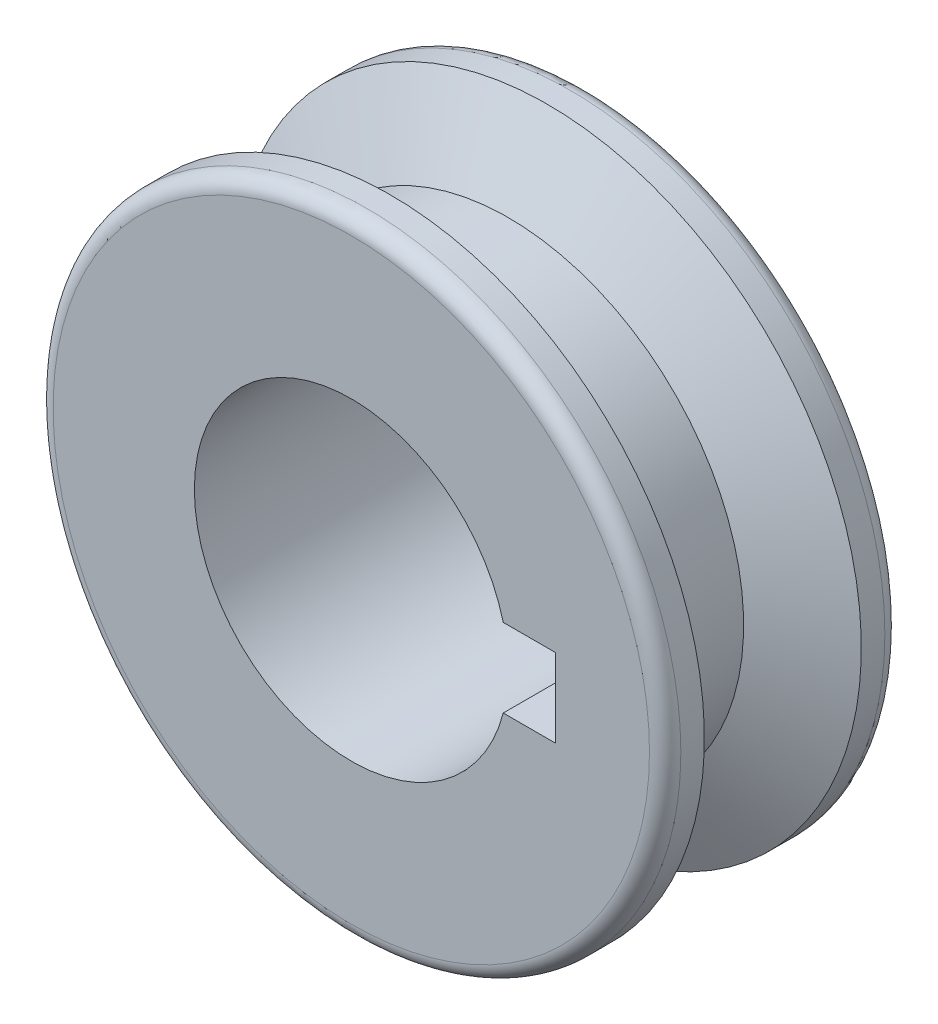
ISO-10303-21;
HEADER;
FILE_DESCRIPTION(('STEP AP214'),'2;1');
FILE_NAME('part.step','',(''),(''),'','','');
FILE_SCHEMA(('AUTOMOTIVE_DESIGN { 1 0 10303 214 1 1 1 1 }'));
ENDSEC;
DATA;
#1=APPLICATION_CONTEXT('core data for automotive mechanical design processes');
#2=APPLICATION_PROTOCOL_DEFINITION('international standard','automotive_design',2000,#1);
#3=PRODUCT_CONTEXT('',#1,'mechanical');
#4=PRODUCT('Part','Part','',(#3));
#5=PRODUCT_RELATED_PRODUCT_CATEGORY('part','',(#4));
#6=PRODUCT_DEFINITION_FORMATION('','',#4);
#7=PRODUCT_DEFINITION_CONTEXT('part definition',#1,'design');
#8=PRODUCT_DEFINITION('design','',#6,#7);
#9=PRODUCT_DEFINITION_SHAPE('','',#8);
#10=(LENGTH_UNIT() NAMED_UNIT(*) SI_UNIT(.MILLI.,.METRE.));
#11=(NAMED_UNIT(*) PLANE_ANGLE_UNIT() SI_UNIT($,.RADIAN.));
#12=(NAMED_UNIT(*) SI_UNIT($,.STERADIAN.) SOLID_ANGLE_UNIT());
#13=UNCERTAINTY_MEASURE_WITH_UNIT(LENGTH_MEASURE(1.E-05),#10,'distance_accuracy_value','');
#14=(GEOMETRIC_REPRESENTATION_CONTEXT(3) GLOBAL_UNCERTAINTY_ASSIGNED_CONTEXT((#13)) GLOBAL_UNIT_ASSIGNED_CONTEXT((#10,
#11,#12)) REPRESENTATION_CONTEXT('',''));
#15=CARTESIAN_POINT('',(0.,0.,0.));
#16=DIRECTION('',(0.,0.,1.));
#17=DIRECTION('',(1.,0.,0.));
#18=AXIS2_PLACEMENT_3D('',#15,#16,#17);
#19=CARTESIAN_POINT('',(0.,0.,15.));
#20=DIRECTION('',(0.,0.,1.));
#21=DIRECTION('',(1.,0.,0.));
#22=AXIS2_PLACEMENT_3D('',#19,#20,#21);
#23=PLANE('',#22);
#24=CARTESIAN_POINT('',(0.,0.,15.));
#25=DIRECTION('',(0.,0.,1.));
#26=DIRECTION('',(1.,0.,0.));
#27=AXIS2_PLACEMENT_3D('',#24,#25,#26);
#28=CIRCLE('',#27,19.);
#29=CARTESIAN_POINT('',(19.,0.,15.));
#30=VERTEX_POINT('',#29);
#31=EDGE_CURVE('E87',#30,#30,#28,.T.);
#32=ORIENTED_EDGE('',*,*,#31,.T.);
#33=EDGE_LOOP('',(#32));
#34=FACE_BOUND('',#33,.T.);
#35=DIRECTION('',(0.,1.,0.));
#36=VECTOR('',#35,1.);
#37=CARTESIAN_POINT('',(13.,0.,15.));
#38=LINE('',#37,#36);
#39=CARTESIAN_POINT('',(13.,-2.5,15.));
#40=VERTEX_POINT('',#39);
#41=CARTESIAN_POINT('',(13.,2.5,15.));
#42=VERTEX_POINT('',#41);
#43=EDGE_CURVE('E104',#40,#42,#38,.T.);
#44=ORIENTED_EDGE('',*,*,#43,.F.);
#45=DIRECTION('',(-1.,0.,0.));
#46=VECTOR('',#45,1.);
#47=CARTESIAN_POINT('',(0.,-2.5,15.));
#48=LINE('',#47,#46);
#49=CARTESIAN_POINT('',(9.68245836551854,-2.5,15.));
#50=VERTEX_POINT('',#49);
#51=EDGE_CURVE('E91',#40,#50,#48,.T.);
#52=ORIENTED_EDGE('',*,*,#51,.T.);
#53=CARTESIAN_POINT('',(0.,0.,15.));
#54=DIRECTION('',(0.,0.,1.));
#55=DIRECTION('',(1.,0.,0.));
#56=AXIS2_PLACEMENT_3D('',#53,#54,#55);
#57=CIRCLE('',#56,10.);
#58=CARTESIAN_POINT('',(9.68245836551854,2.5,15.));
#59=VERTEX_POINT('',#58);
#60=EDGE_CURVE('E118',#59,#50,#57,.T.);
#61=ORIENTED_EDGE('',*,*,#60,.F.);
#62=DIRECTION('',(1.,0.,0.));
#63=VECTOR('',#62,1.);
#64=CARTESIAN_POINT('',(0.,2.5,15.));
#65=LINE('',#64,#63);
#66=EDGE_CURVE('E50',#59,#42,#65,.T.);
#67=ORIENTED_EDGE('',*,*,#66,.T.);
#68=EDGE_LOOP('',(#44,#52,#61,#67));
#69=FACE_BOUND('',#68,.T.);
#70=ADVANCED_FACE('F35',(#34,#69),#23,.T.);
#71=CARTESIAN_POINT('',(0.,0.,0.));
#72=DIRECTION('',(0.,0.,1.));
#73=DIRECTION('',(1.,0.,0.));
#74=AXIS2_PLACEMENT_3D('',#71,#72,#73);
#75=PLANE('',#74);
#76=CARTESIAN_POINT('',(0.,0.,0.));
#77=DIRECTION('',(0.,0.,1.));
#78=DIRECTION('',(1.,0.,0.));
#79=AXIS2_PLACEMENT_3D('',#76,#77,#78);
#80=CIRCLE('',#79,19.);
#81=CARTESIAN_POINT('',(19.,0.,0.));
#82=VERTEX_POINT('',#81);
#83=EDGE_CURVE('E11',#82,#82,#80,.F.);
#84=ORIENTED_EDGE('',*,*,#83,.T.);
#85=EDGE_LOOP('',(#84));
#86=FACE_BOUND('',#85,.T.);
#87=DIRECTION('',(-1.,0.,0.));
#88=VECTOR('',#87,1.);
#89=CARTESIAN_POINT('',(13.,-2.5,0.));
#90=LINE('',#89,#88);
#91=CARTESIAN_POINT('',(13.,-2.5,0.));
#92=VERTEX_POINT('',#91);
#93=CARTESIAN_POINT('',(9.68245836551854,-2.5,0.));
#94=VERTEX_POINT('',#93);
#95=EDGE_CURVE('E90',#92,#94,#90,.T.);
#96=ORIENTED_EDGE('',*,*,#95,.F.);
#97=DIRECTION('',(0.,1.,0.));
#98=VECTOR('',#97,1.);
#99=CARTESIAN_POINT('',(13.,0.,0.));
#100=LINE('',#99,#98);
#101=CARTESIAN_POINT('',(13.,2.5,0.));
#102=VERTEX_POINT('',#101);
#103=EDGE_CURVE('E78',#92,#102,#100,.T.);
#104=ORIENTED_EDGE('',*,*,#103,.T.);
#105=DIRECTION('',(-1.,0.,0.));
#106=VECTOR('',#105,1.);
#107=CARTESIAN_POINT('',(13.,2.5,0.));
#108=LINE('',#107,#106);
#109=CARTESIAN_POINT('',(9.68245836551854,2.5,0.));
#110=VERTEX_POINT('',#109);
#111=EDGE_CURVE('E97',#102,#110,#108,.T.);
#112=ORIENTED_EDGE('',*,*,#111,.T.);
#113=CARTESIAN_POINT('',(0.,0.,0.));
#114=DIRECTION('',(0.,0.,1.));
#115=DIRECTION('',(1.,0.,0.));
#116=AXIS2_PLACEMENT_3D('',#113,#114,#115);
#117=CIRCLE('',#116,10.);
#118=EDGE_CURVE('E96',#110,#94,#117,.T.);
#119=ORIENTED_EDGE('',*,*,#118,.T.);
#120=EDGE_LOOP('',(#96,#104,#112,#119));
#121=FACE_BOUND('',#120,.T.);
#122=ADVANCED_FACE('F94',(#86,#121),#75,.F.);
#123=CARTESIAN_POINT('',(0.,0.,15.));
#124=DIRECTION('',(0.,0.,-1.));
#125=DIRECTION('',(-1.,0.,0.));
#126=AXIS2_PLACEMENT_3D('',#123,#124,#125);
#127=CYLINDRICAL_SURFACE('',#126,10.);
#128=ORIENTED_EDGE('',*,*,#60,.T.);
#129=DIRECTION('',(0.,0.,-1.));
#130=VECTOR('',#129,1.);
#131=CARTESIAN_POINT('',(9.68245836551854,-2.5,15.));
#132=LINE('',#131,#130);
#133=EDGE_CURVE('E58',#50,#94,#132,.T.);
#134=ORIENTED_EDGE('',*,*,#133,.T.);
#135=ORIENTED_EDGE('',*,*,#118,.F.);
#136=DIRECTION('',(0.,0.,-1.));
#137=VECTOR('',#136,1.);
#138=CARTESIAN_POINT('',(9.68245836551854,2.5,15.));
#139=LINE('',#138,#137);
#140=EDGE_CURVE('E121',#110,#59,#139,.F.);
#141=ORIENTED_EDGE('',*,*,#140,.T.);
#142=EDGE_LOOP('',(#128,#134,#135,#141));
#143=FACE_BOUND('',#142,.T.);
#144=ADVANCED_FACE('F150',(#143),#127,.F.);
#145=CARTESIAN_POINT('',(0.,0.,15.));
#146=DIRECTION('',(0.,0.,-1.));
#147=DIRECTION('',(-1.,0.,0.));
#148=AXIS2_PLACEMENT_3D('',#145,#146,#147);
#149=CYLINDRICAL_SURFACE('',#148,20.);
#150=CARTESIAN_POINT('',(0.,0.,1.));
#151=DIRECTION('',(0.,0.,1.));
#152=DIRECTION('',(1.,0.,0.));
#153=AXIS2_PLACEMENT_3D('',#150,#151,#152);
#154=CIRCLE('',#153,20.);
#155=CARTESIAN_POINT('',(20.,0.,1.));
#156=VERTEX_POINT('',#155);
#157=EDGE_CURVE('E43',#156,#156,#154,.T.);
#158=ORIENTED_EDGE('',*,*,#157,.T.);
#159=EDGE_LOOP('',(#158));
#160=FACE_BOUND('',#159,.T.);
#161=CARTESIAN_POINT('',(0.,0.,2.5));
#162=DIRECTION('',(0.,0.,-1.));
#163=DIRECTION('',(-1.,0.,0.));
#164=AXIS2_PLACEMENT_3D('',#161,#162,#163);
#165=CIRCLE('',#164,20.);
#166=CARTESIAN_POINT('',(-20.,0.,2.5));
#167=VERTEX_POINT('',#166);
#168=EDGE_CURVE('E106',#167,#167,#165,.T.);
#169=ORIENTED_EDGE('',*,*,#168,.T.);
#170=EDGE_LOOP('',(#169));
#171=FACE_BOUND('',#170,.T.);
#172=ADVANCED_FACE('F132',(#160,#171),#149,.T.);
#173=CARTESIAN_POINT('',(0.,0.,14.));
#174=DIRECTION('',(0.,0.,1.));
#175=DIRECTION('',(1.,0.,0.));
#176=AXIS2_PLACEMENT_3D('',#173,#174,#175);
#177=CIRCLE('',#176,20.);
#178=CARTESIAN_POINT('',(20.,0.,14.));
#179=VERTEX_POINT('',#178);
#180=EDGE_CURVE('E127',#179,#179,#177,.F.);
#181=ORIENTED_EDGE('',*,*,#180,.T.);
#182=EDGE_LOOP('',(#181));
#183=FACE_BOUND('',#182,.T.);
#184=CARTESIAN_POINT('',(0.,0.,12.5));
#185=DIRECTION('',(0.,0.,-1.));
#186=DIRECTION('',(-1.,0.,0.));
#187=AXIS2_PLACEMENT_3D('',#184,#185,#186);
#188=CIRCLE('',#187,20.);
#189=CARTESIAN_POINT('',(-20.,0.,12.5));
#190=VERTEX_POINT('',#189);
#191=EDGE_CURVE('E115',#190,#190,#188,.T.);
#192=ORIENTED_EDGE('',*,*,#191,.F.);
#193=EDGE_LOOP('',(#192));
#194=FACE_BOUND('',#193,.T.);
#195=ADVANCED_FACE('F157',(#183,#194),#149,.T.);
#196=CARTESIAN_POINT('',(0.,0.,12.5));
#197=DIRECTION('',(0.,0.,1.));
#198=DIRECTION('',(1.,0.,0.));
#199=AXIS2_PLACEMENT_3D('',#196,#197,#198);
#200=CONICAL_SURFACE('',#199,20.,1.10714871779409);
#201=CARTESIAN_POINT('',(0.,0.,10.));
#202=DIRECTION('',(0.,0.,-1.));
#203=DIRECTION('',(-1.,0.,0.));
#204=AXIS2_PLACEMENT_3D('',#201,#202,#203);
#205=CIRCLE('',#204,15.);
#206=CARTESIAN_POINT('',(-15.,0.,10.));
#207=VERTEX_POINT('',#206);
#208=EDGE_CURVE('E112',#207,#207,#205,.T.);
#209=ORIENTED_EDGE('',*,*,#208,.F.);
#210=EDGE_LOOP('',(#209));
#211=FACE_BOUND('',#210,.T.);
#212=ORIENTED_EDGE('',*,*,#191,.T.);
#213=EDGE_LOOP('',(#212));
#214=FACE_BOUND('',#213,.T.);
#215=ADVANCED_FACE('F159',(#211,#214),#200,.T.);
#216=CARTESIAN_POINT('',(0.,0.,-0.750000000000001));
#217=DIRECTION('',(0.,0.,-1.));
#218=DIRECTION('',(-1.,0.,0.));
#219=AXIS2_PLACEMENT_3D('',#216,#217,#218);
#220=CYLINDRICAL_SURFACE('',#219,15.);
#221=CARTESIAN_POINT('',(0.,0.,5.));
#222=DIRECTION('',(0.,0.,-1.));
#223=DIRECTION('',(-1.,0.,0.));
#224=AXIS2_PLACEMENT_3D('',#221,#222,#223);
#225=CIRCLE('',#224,15.);
#226=CARTESIAN_POINT('',(-15.,0.,5.));
#227=VERTEX_POINT('',#226);
#228=EDGE_CURVE('E109',#227,#227,#225,.T.);
#229=ORIENTED_EDGE('',*,*,#228,.F.);
#230=EDGE_LOOP('',(#229));
#231=FACE_BOUND('',#230,.T.);
#232=ORIENTED_EDGE('',*,*,#208,.T.);
#233=EDGE_LOOP('',(#232));
#234=FACE_BOUND('',#233,.T.);
#235=ADVANCED_FACE('F165',(#231,#234),#220,.T.);
#236=CARTESIAN_POINT('',(0.,0.,2.5));
#237=DIRECTION('',(0.,0.,-1.));
#238=DIRECTION('',(-1.,0.,0.));
#239=AXIS2_PLACEMENT_3D('',#236,#237,#238);
#240=CONICAL_SURFACE('',#239,20.,1.10714871779409);
#241=ORIENTED_EDGE('',*,*,#228,.T.);
#242=EDGE_LOOP('',(#241));
#243=FACE_BOUND('',#242,.T.);
#244=ORIENTED_EDGE('',*,*,#168,.F.);
#245=EDGE_LOOP('',(#244));
#246=FACE_BOUND('',#245,.T.);
#247=ADVANCED_FACE('F188',(#243,#246),#240,.T.);
#248=CARTESIAN_POINT('',(13.,0.,15.7355760296696));
#249=DIRECTION('',(1.,0.,0.));
#250=DIRECTION('',(0.,0.,-1.));
#251=AXIS2_PLACEMENT_3D('',#248,#249,#250);
#252=PLANE('',#251);
#253=ORIENTED_EDGE('',*,*,#43,.T.);
#254=DIRECTION('',(0.,0.,1.));
#255=VECTOR('',#254,1.);
#256=CARTESIAN_POINT('',(13.,2.5,15.7355760296696));
#257=LINE('',#256,#255);
#258=EDGE_CURVE('E83',#102,#42,#257,.T.);
#259=ORIENTED_EDGE('',*,*,#258,.F.);
#260=ORIENTED_EDGE('',*,*,#103,.F.);
#261=DIRECTION('',(0.,0.,-1.));
#262=VECTOR('',#261,1.);
#263=CARTESIAN_POINT('',(13.,-2.5,15.7355760296696));
#264=LINE('',#263,#262);
#265=EDGE_CURVE('E81',#40,#92,#264,.T.);
#266=ORIENTED_EDGE('',*,*,#265,.F.);
#267=EDGE_LOOP('',(#253,#259,#260,#266));
#268=FACE_BOUND('',#267,.T.);
#269=ADVANCED_FACE('F80',(#268),#252,.F.);
#270=CARTESIAN_POINT('',(13.,-2.5,15.7355760296696));
#271=DIRECTION('',(0.,1.,0.));
#272=DIRECTION('',(0.,0.,1.));
#273=AXIS2_PLACEMENT_3D('',#270,#271,#272);
#274=PLANE('',#273);
#275=ORIENTED_EDGE('',*,*,#265,.T.);
#276=ORIENTED_EDGE('',*,*,#95,.T.);
#277=ORIENTED_EDGE('',*,*,#133,.F.);
#278=ORIENTED_EDGE('',*,*,#51,.F.);
#279=EDGE_LOOP('',(#275,#276,#277,#278));
#280=FACE_BOUND('',#279,.T.);
#281=ADVANCED_FACE('F89',(#280),#274,.T.);
#282=CARTESIAN_POINT('',(13.,2.5,15.7355760296696));
#283=DIRECTION('',(0.,-1.,0.));
#284=DIRECTION('',(0.,0.,-1.));
#285=AXIS2_PLACEMENT_3D('',#282,#283,#284);
#286=PLANE('',#285);
#287=ORIENTED_EDGE('',*,*,#140,.F.);
#288=ORIENTED_EDGE('',*,*,#111,.F.);
#289=ORIENTED_EDGE('',*,*,#258,.T.);
#290=ORIENTED_EDGE('',*,*,#66,.F.);
#291=EDGE_LOOP('',(#287,#288,#289,#290));
#292=FACE_BOUND('',#291,.T.);
#293=ADVANCED_FACE('F141',(#292),#286,.T.);
#294=CARTESIAN_POINT('',(0.,0.,14.));
#295=DIRECTION('',(0.,0.,1.));
#296=DIRECTION('',(1.,0.,0.));
#297=AXIS2_PLACEMENT_3D('',#294,#295,#296);
#298=TOROIDAL_SURFACE('',#297,19.,1.);
#299=ORIENTED_EDGE('',*,*,#180,.F.);
#300=EDGE_LOOP('',(#299));
#301=FACE_BOUND('',#300,.T.);
#302=ORIENTED_EDGE('',*,*,#31,.F.);
#303=EDGE_LOOP('',(#302));
#304=FACE_BOUND('',#303,.T.);
#305=ADVANCED_FACE('F136',(#301,#304),#298,.T.);
#306=CARTESIAN_POINT('',(0.,0.,1.));
#307=DIRECTION('',(0.,0.,1.));
#308=DIRECTION('',(1.,0.,0.));
#309=AXIS2_PLACEMENT_3D('',#306,#307,#308);
#310=TOROIDAL_SURFACE('',#309,19.,1.);
#311=ORIENTED_EDGE('',*,*,#83,.F.);
#312=EDGE_LOOP('',(#311));
#313=FACE_BOUND('',#312,.T.);
#314=ORIENTED_EDGE('',*,*,#157,.F.);
#315=EDGE_LOOP('',(#314));
#316=FACE_BOUND('',#315,.T.);
#317=ADVANCED_FACE('F37',(#313,#316),#310,.T.);
#318=CLOSED_SHELL('',(#70,#122,#144,#172,#195,#215,#235,#247,#269,#281,#293,#305,#317));
#319=MANIFOLD_SOLID_BREP('B2',#318);
#320=ADVANCED_BREP_SHAPE_REPRESENTATION('',(#18,#319),#14);
#321=SHAPE_DEFINITION_REPRESENTATION(#9,#320);
ENDSEC;
END-ISO-10303-21;
